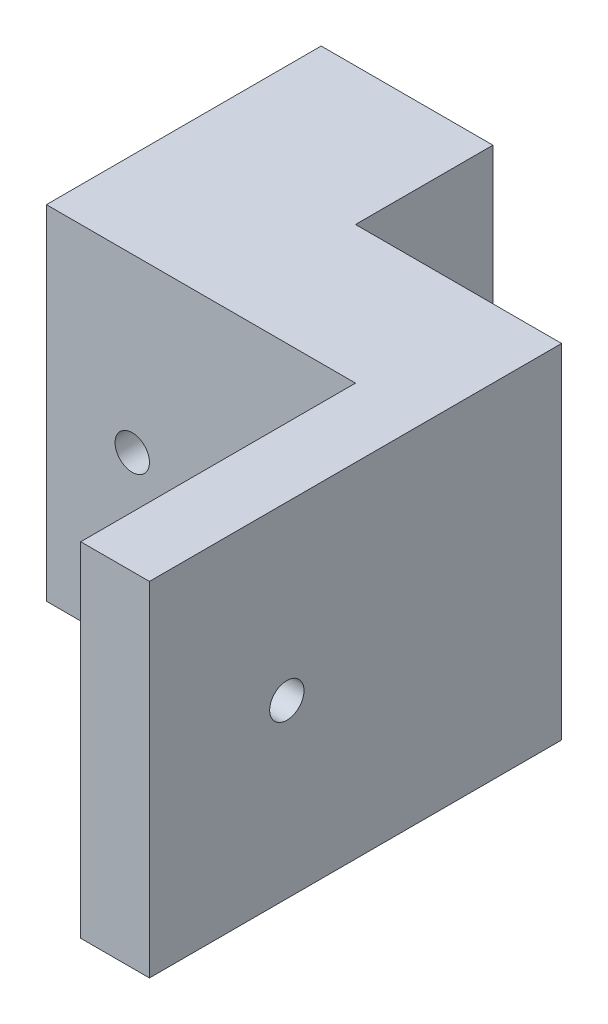
ISO-10303-21;
HEADER;
FILE_DESCRIPTION(('STEP AP214'),'2;1');
FILE_NAME('part.step','',(''),(''),'','','');
FILE_SCHEMA(('AUTOMOTIVE_DESIGN { 1 0 10303 214 1 1 1 1 }'));
ENDSEC;
DATA;
#1=APPLICATION_CONTEXT('core data for automotive mechanical design processes');
#2=APPLICATION_PROTOCOL_DEFINITION('international standard','automotive_design',2000,#1);
#3=PRODUCT_CONTEXT('',#1,'mechanical');
#4=PRODUCT('Part','Part','',(#3));
#5=PRODUCT_RELATED_PRODUCT_CATEGORY('part','',(#4));
#6=PRODUCT_DEFINITION_FORMATION('','',#4);
#7=PRODUCT_DEFINITION_CONTEXT('part definition',#1,'design');
#8=PRODUCT_DEFINITION('design','',#6,#7);
#9=PRODUCT_DEFINITION_SHAPE('','',#8);
#10=(LENGTH_UNIT() NAMED_UNIT(*) SI_UNIT(.MILLI.,.METRE.));
#11=(NAMED_UNIT(*) PLANE_ANGLE_UNIT() SI_UNIT($,.RADIAN.));
#12=(NAMED_UNIT(*) SI_UNIT($,.STERADIAN.) SOLID_ANGLE_UNIT());
#13=UNCERTAINTY_MEASURE_WITH_UNIT(LENGTH_MEASURE(1.E-05),#10,'distance_accuracy_value','');
#14=(GEOMETRIC_REPRESENTATION_CONTEXT(3) GLOBAL_UNCERTAINTY_ASSIGNED_CONTEXT((#13)) GLOBAL_UNIT_ASSIGNED_CONTEXT((#10,
#11,#12)) REPRESENTATION_CONTEXT('',''));
#15=CARTESIAN_POINT('',(0.,0.,0.));
#16=DIRECTION('',(0.,0.,1.));
#17=DIRECTION('',(1.,0.,0.));
#18=AXIS2_PLACEMENT_3D('',#15,#16,#17);
#19=CARTESIAN_POINT('',(-41.0872907389554,30.3800892133009,20.));
#20=DIRECTION('',(1.,0.,0.));
#21=DIRECTION('',(0.,0.,-1.));
#22=AXIS2_PLACEMENT_3D('',#19,#20,#21);
#23=PLANE('',#22);
#24=DIRECTION('',(0.,-1.,0.));
#25=VECTOR('',#24,1.);
#26=CARTESIAN_POINT('',(-41.0872907389554,30.3800892133009,0.));
#27=LINE('',#26,#25);
#28=CARTESIAN_POINT('',(-41.0872907389554,30.3800892133009,0.));
#29=VERTEX_POINT('',#28);
#30=CARTESIAN_POINT('',(-41.0872907389554,-19.6199107866991,0.));
#31=VERTEX_POINT('',#30);
#32=EDGE_CURVE('E90',#29,#31,#27,.T.);
#33=ORIENTED_EDGE('',*,*,#32,.T.);
#34=DIRECTION('',(0.,0.,-1.));
#35=VECTOR('',#34,1.);
#36=CARTESIAN_POINT('',(-41.0872907389554,-19.6199107866991,20.));
#37=LINE('',#36,#35);
#38=CARTESIAN_POINT('',(-41.0872907389554,-19.6199107866991,40.));
#39=VERTEX_POINT('',#38);
#40=EDGE_CURVE('E11',#39,#31,#37,.T.);
#41=ORIENTED_EDGE('',*,*,#40,.F.);
#42=DIRECTION('',(0.,-1.,0.));
#43=VECTOR('',#42,1.);
#44=CARTESIAN_POINT('',(-41.0872907389554,30.3800892133009,40.));
#45=LINE('',#44,#43);
#46=CARTESIAN_POINT('',(-41.0872907389554,30.3800892133009,40.));
#47=VERTEX_POINT('',#46);
#48=EDGE_CURVE('E119',#47,#39,#45,.T.);
#49=ORIENTED_EDGE('',*,*,#48,.F.);
#50=DIRECTION('',(0.,0.,-1.));
#51=VECTOR('',#50,1.);
#52=CARTESIAN_POINT('',(-41.0872907389554,30.3800892133009,20.));
#53=LINE('',#52,#51);
#54=EDGE_CURVE('E85',#47,#29,#53,.T.);
#55=ORIENTED_EDGE('',*,*,#54,.T.);
#56=EDGE_LOOP('',(#33,#41,#49,#55));
#57=FACE_BOUND('',#56,.T.);
#58=ADVANCED_FACE('F35',(#57),#23,.F.);
#59=CARTESIAN_POINT('',(-41.0872907389554,-19.6199107866991,20.));
#60=DIRECTION('',(0.,1.,0.));
#61=DIRECTION('',(0.,0.,1.));
#62=AXIS2_PLACEMENT_3D('',#59,#60,#61);
#63=PLANE('',#62);
#64=DIRECTION('',(1.,0.,0.));
#65=VECTOR('',#64,1.);
#66=CARTESIAN_POINT('',(-41.0872907389554,-19.6199107866991,0.));
#67=LINE('',#66,#65);
#68=CARTESIAN_POINT('',(-16.0872907389554,-19.6199107866991,0.));
#69=VERTEX_POINT('',#68);
#70=EDGE_CURVE('E75',#31,#69,#67,.T.);
#71=ORIENTED_EDGE('',*,*,#70,.T.);
#72=DIRECTION('',(0.,0.,-1.));
#73=VECTOR('',#72,1.);
#74=CARTESIAN_POINT('',(-16.0872907389554,-19.6199107866991,20.));
#75=LINE('',#74,#73);
#76=CARTESIAN_POINT('',(-16.0872907389554,-19.6199107866991,20.));
#77=VERTEX_POINT('',#76);
#78=EDGE_CURVE('E44',#77,#69,#75,.T.);
#79=ORIENTED_EDGE('',*,*,#78,.F.);
#80=DIRECTION('',(1.,0.,0.));
#81=VECTOR('',#80,1.);
#82=CARTESIAN_POINT('',(-41.0872907389554,-19.6199107866991,20.));
#83=LINE('',#82,#81);
#84=CARTESIAN_POINT('',(13.9127092610446,-19.6199107866991,20.));
#85=VERTEX_POINT('',#84);
#86=EDGE_CURVE('E104',#77,#85,#83,.T.);
#87=ORIENTED_EDGE('',*,*,#86,.T.);
#88=DIRECTION('',(0.,0.,-1.));
#89=VECTOR('',#88,1.);
#90=CARTESIAN_POINT('',(13.9127092610446,-19.6199107866991,0.));
#91=LINE('',#90,#89);
#92=CARTESIAN_POINT('',(13.9127092610446,-19.6199107866991,80.));
#93=VERTEX_POINT('',#92);
#94=EDGE_CURVE('E154',#93,#85,#91,.T.);
#95=ORIENTED_EDGE('',*,*,#94,.F.);
#96=DIRECTION('',(-1.,0.,0.));
#97=VECTOR('',#96,1.);
#98=CARTESIAN_POINT('',(13.9127092610446,-19.6199107866991,80.));
#99=LINE('',#98,#97);
#100=CARTESIAN_POINT('',(3.91270926104458,-19.6199107866991,80.));
#101=VERTEX_POINT('',#100);
#102=EDGE_CURVE('E155',#93,#101,#99,.T.);
#103=ORIENTED_EDGE('',*,*,#102,.T.);
#104=DIRECTION('',(0.,0.,-1.));
#105=VECTOR('',#104,1.);
#106=CARTESIAN_POINT('',(3.91270926104458,-19.6199107866991,0.));
#107=LINE('',#106,#105);
#108=CARTESIAN_POINT('',(3.91270926104458,-19.6199107866991,40.));
#109=VERTEX_POINT('',#108);
#110=EDGE_CURVE('E145',#101,#109,#107,.T.);
#111=ORIENTED_EDGE('',*,*,#110,.T.);
#112=DIRECTION('',(1.,0.,0.));
#113=VECTOR('',#112,1.);
#114=CARTESIAN_POINT('',(-41.0872907389554,-19.6199107866991,40.));
#115=LINE('',#114,#113);
#116=EDGE_CURVE('E114',#39,#109,#115,.T.);
#117=ORIENTED_EDGE('',*,*,#116,.F.);
#118=ORIENTED_EDGE('',*,*,#40,.T.);
#119=EDGE_LOOP('',(#71,#79,#87,#95,#103,#111,#117,#118));
#120=FACE_BOUND('',#119,.T.);
#121=ADVANCED_FACE('F108',(#120),#63,.F.);
#122=CARTESIAN_POINT('',(-16.0872907389554,30.3800892133009,20.));
#123=DIRECTION('',(-1.,0.,0.));
#124=DIRECTION('',(0.,0.,1.));
#125=AXIS2_PLACEMENT_3D('',#122,#123,#124);
#126=PLANE('',#125);
#127=DIRECTION('',(0.,1.,0.));
#128=VECTOR('',#127,1.);
#129=CARTESIAN_POINT('',(-16.0872907389554,30.3800892133009,0.));
#130=LINE('',#129,#128);
#131=CARTESIAN_POINT('',(-16.0872907389554,30.3800892133009,0.));
#132=VERTEX_POINT('',#131);
#133=EDGE_CURVE('E67',#69,#132,#130,.T.);
#134=ORIENTED_EDGE('',*,*,#133,.T.);
#135=DIRECTION('',(0.,0.,-1.));
#136=VECTOR('',#135,1.);
#137=CARTESIAN_POINT('',(-16.0872907389554,30.3800892133009,20.));
#138=LINE('',#137,#136);
#139=CARTESIAN_POINT('',(-16.0872907389554,30.3800892133009,20.));
#140=VERTEX_POINT('',#139);
#141=EDGE_CURVE('E70',#140,#132,#138,.T.);
#142=ORIENTED_EDGE('',*,*,#141,.F.);
#143=DIRECTION('',(0.,1.,0.));
#144=VECTOR('',#143,1.);
#145=CARTESIAN_POINT('',(-16.0872907389554,30.3800892133009,20.));
#146=LINE('',#145,#144);
#147=EDGE_CURVE('E91',#77,#140,#146,.T.);
#148=ORIENTED_EDGE('',*,*,#147,.F.);
#149=ORIENTED_EDGE('',*,*,#78,.T.);
#150=EDGE_LOOP('',(#134,#142,#148,#149));
#151=FACE_BOUND('',#150,.T.);
#152=ADVANCED_FACE('F69',(#151),#126,.F.);
#153=CARTESIAN_POINT('',(-41.0872907389554,30.3800892133009,20.));
#154=DIRECTION('',(0.,-1.,0.));
#155=DIRECTION('',(0.,0.,-1.));
#156=AXIS2_PLACEMENT_3D('',#153,#154,#155);
#157=PLANE('',#156);
#158=DIRECTION('',(-1.,0.,0.));
#159=VECTOR('',#158,1.);
#160=CARTESIAN_POINT('',(-41.0872907389554,30.3800892133009,0.));
#161=LINE('',#160,#159);
#162=EDGE_CURVE('E74',#132,#29,#161,.T.);
#163=ORIENTED_EDGE('',*,*,#162,.T.);
#164=ORIENTED_EDGE('',*,*,#54,.F.);
#165=DIRECTION('',(-1.,0.,0.));
#166=VECTOR('',#165,1.);
#167=CARTESIAN_POINT('',(-41.0872907389554,30.3800892133009,40.));
#168=LINE('',#167,#166);
#169=CARTESIAN_POINT('',(3.91270926104458,30.3800892133009,40.));
#170=VERTEX_POINT('',#169);
#171=EDGE_CURVE('E107',#170,#47,#168,.T.);
#172=ORIENTED_EDGE('',*,*,#171,.F.);
#173=DIRECTION('',(0.,0.,1.));
#174=VECTOR('',#173,1.);
#175=CARTESIAN_POINT('',(3.91270926104458,30.3800892133009,0.));
#176=LINE('',#175,#174);
#177=CARTESIAN_POINT('',(3.91270926104458,30.3800892133009,80.));
#178=VERTEX_POINT('',#177);
#179=EDGE_CURVE('E137',#170,#178,#176,.T.);
#180=ORIENTED_EDGE('',*,*,#179,.T.);
#181=DIRECTION('',(-1.,0.,0.));
#182=VECTOR('',#181,1.);
#183=CARTESIAN_POINT('',(13.9127092610446,30.3800892133009,80.));
#184=LINE('',#183,#182);
#185=CARTESIAN_POINT('',(13.9127092610446,30.3800892133009,80.));
#186=VERTEX_POINT('',#185);
#187=EDGE_CURVE('E157',#186,#178,#184,.T.);
#188=ORIENTED_EDGE('',*,*,#187,.F.);
#189=DIRECTION('',(0.,0.,1.));
#190=VECTOR('',#189,1.);
#191=CARTESIAN_POINT('',(13.9127092610446,30.3800892133009,0.));
#192=LINE('',#191,#190);
#193=CARTESIAN_POINT('',(13.9127092610446,30.3800892133009,20.));
#194=VERTEX_POINT('',#193);
#195=EDGE_CURVE('E180',#194,#186,#192,.T.);
#196=ORIENTED_EDGE('',*,*,#195,.F.);
#197=DIRECTION('',(-1.,0.,0.));
#198=VECTOR('',#197,1.);
#199=CARTESIAN_POINT('',(-41.0872907389554,30.3800892133009,20.));
#200=LINE('',#199,#198);
#201=EDGE_CURVE('E84',#194,#140,#200,.T.);
#202=ORIENTED_EDGE('',*,*,#201,.T.);
#203=ORIENTED_EDGE('',*,*,#141,.T.);
#204=EDGE_LOOP('',(#163,#164,#172,#180,#188,#196,#202,#203));
#205=FACE_BOUND('',#204,.T.);
#206=ADVANCED_FACE('F79',(#205),#157,.F.);
#207=CARTESIAN_POINT('',(0.,0.,0.));
#208=DIRECTION('',(0.,0.,1.));
#209=DIRECTION('',(1.,0.,0.));
#210=AXIS2_PLACEMENT_3D('',#207,#208,#209);
#211=PLANE('',#210);
#212=CARTESIAN_POINT('',(-28.5872907389554,5.38008921330089,0.));
#213=DIRECTION('',(0.,0.,-1.));
#214=DIRECTION('',(-1.,0.,0.));
#215=AXIS2_PLACEMENT_3D('',#212,#213,#214);
#216=CIRCLE('',#215,2.49999999999999);
#217=CARTESIAN_POINT('',(-31.0872907389554,5.38008921330089,0.));
#218=VERTEX_POINT('',#217);
#219=EDGE_CURVE('E208',#218,#218,#216,.T.);
#220=ORIENTED_EDGE('',*,*,#219,.F.);
#221=EDGE_LOOP('',(#220));
#222=FACE_BOUND('',#221,.T.);
#223=ORIENTED_EDGE('',*,*,#32,.F.);
#224=ORIENTED_EDGE('',*,*,#162,.F.);
#225=ORIENTED_EDGE('',*,*,#133,.F.);
#226=ORIENTED_EDGE('',*,*,#70,.F.);
#227=EDGE_LOOP('',(#223,#224,#225,#226));
#228=FACE_BOUND('',#227,.T.);
#229=ADVANCED_FACE('F88',(#222,#228),#211,.F.);
#230=CARTESIAN_POINT('',(0.,0.,20.));
#231=DIRECTION('',(0.,0.,1.));
#232=DIRECTION('',(1.,0.,0.));
#233=AXIS2_PLACEMENT_3D('',#230,#231,#232);
#234=PLANE('',#233);
#235=ORIENTED_EDGE('',*,*,#86,.F.);
#236=ORIENTED_EDGE('',*,*,#147,.T.);
#237=ORIENTED_EDGE('',*,*,#201,.F.);
#238=DIRECTION('',(0.,1.,0.));
#239=VECTOR('',#238,1.);
#240=CARTESIAN_POINT('',(13.9127092610446,0.,20.));
#241=LINE('',#240,#239);
#242=EDGE_CURVE('E176',#85,#194,#241,.T.);
#243=ORIENTED_EDGE('',*,*,#242,.F.);
#244=EDGE_LOOP('',(#235,#236,#237,#243));
#245=FACE_BOUND('',#244,.T.);
#246=ADVANCED_FACE('F177',(#245),#234,.F.);
#247=CARTESIAN_POINT('',(0.,0.,40.));
#248=DIRECTION('',(0.,0.,1.));
#249=DIRECTION('',(1.,0.,0.));
#250=AXIS2_PLACEMENT_3D('',#247,#248,#249);
#251=PLANE('',#250);
#252=CARTESIAN_POINT('',(-28.5872907389554,5.38008921330089,40.));
#253=DIRECTION('',(0.,0.,1.));
#254=DIRECTION('',(1.,0.,0.));
#255=AXIS2_PLACEMENT_3D('',#252,#253,#254);
#256=CIRCLE('',#255,2.49999999999999);
#257=CARTESIAN_POINT('',(-26.0872907389554,5.38008921330089,40.));
#258=VERTEX_POINT('',#257);
#259=EDGE_CURVE('E204',#258,#258,#256,.T.);
#260=ORIENTED_EDGE('',*,*,#259,.F.);
#261=EDGE_LOOP('',(#260));
#262=FACE_BOUND('',#261,.T.);
#263=ORIENTED_EDGE('',*,*,#48,.T.);
#264=ORIENTED_EDGE('',*,*,#116,.T.);
#265=DIRECTION('',(0.,1.,0.));
#266=VECTOR('',#265,1.);
#267=CARTESIAN_POINT('',(3.91270926104458,-19.6199107866991,40.));
#268=LINE('',#267,#266);
#269=EDGE_CURVE('E128',#109,#170,#268,.T.);
#270=ORIENTED_EDGE('',*,*,#269,.T.);
#271=ORIENTED_EDGE('',*,*,#171,.T.);
#272=EDGE_LOOP('',(#263,#264,#270,#271));
#273=FACE_BOUND('',#272,.T.);
#274=ADVANCED_FACE('F126',(#262,#273),#251,.T.);
#275=CARTESIAN_POINT('',(13.9127092610446,0.,80.));
#276=DIRECTION('',(0.,0.,-1.));
#277=DIRECTION('',(0.,1.,0.));
#278=AXIS2_PLACEMENT_3D('',#275,#276,#277);
#279=PLANE('',#278);
#280=DIRECTION('',(0.,-1.,0.));
#281=VECTOR('',#280,1.);
#282=CARTESIAN_POINT('',(3.91270926104458,0.,80.));
#283=LINE('',#282,#281);
#284=EDGE_CURVE('E144',#178,#101,#283,.T.);
#285=ORIENTED_EDGE('',*,*,#284,.T.);
#286=ORIENTED_EDGE('',*,*,#102,.F.);
#287=DIRECTION('',(0.,-1.,0.));
#288=VECTOR('',#287,1.);
#289=CARTESIAN_POINT('',(13.9127092610446,0.,80.));
#290=LINE('',#289,#288);
#291=EDGE_CURVE('E158',#186,#93,#290,.T.);
#292=ORIENTED_EDGE('',*,*,#291,.F.);
#293=ORIENTED_EDGE('',*,*,#187,.T.);
#294=EDGE_LOOP('',(#285,#286,#292,#293));
#295=FACE_BOUND('',#294,.T.);
#296=ADVANCED_FACE('F193',(#295),#279,.F.);
#297=CARTESIAN_POINT('',(13.9127092610446,0.,0.));
#298=DIRECTION('',(1.,0.,0.));
#299=DIRECTION('',(0.,0.,-1.));
#300=AXIS2_PLACEMENT_3D('',#297,#298,#299);
#301=PLANE('',#300);
#302=CARTESIAN_POINT('',(13.9127092610446,5.38008921330089,60.));
#303=DIRECTION('',(1.,0.,0.));
#304=DIRECTION('',(0.,0.,-1.));
#305=AXIS2_PLACEMENT_3D('',#302,#303,#304);
#306=CIRCLE('',#305,2.5);
#307=CARTESIAN_POINT('',(13.9127092610446,5.38008921330089,57.5));
#308=VERTEX_POINT('',#307);
#309=EDGE_CURVE('E187',#308,#308,#306,.T.);
#310=ORIENTED_EDGE('',*,*,#309,.F.);
#311=EDGE_LOOP('',(#310));
#312=FACE_BOUND('',#311,.T.);
#313=ORIENTED_EDGE('',*,*,#94,.T.);
#314=ORIENTED_EDGE('',*,*,#242,.T.);
#315=ORIENTED_EDGE('',*,*,#195,.T.);
#316=ORIENTED_EDGE('',*,*,#291,.T.);
#317=EDGE_LOOP('',(#313,#314,#315,#316));
#318=FACE_BOUND('',#317,.T.);
#319=ADVANCED_FACE('F183',(#312,#318),#301,.T.);
#320=CARTESIAN_POINT('',(3.91270926104458,0.,0.));
#321=DIRECTION('',(1.,0.,0.));
#322=DIRECTION('',(0.,0.,-1.));
#323=AXIS2_PLACEMENT_3D('',#320,#321,#322);
#324=PLANE('',#323);
#325=CARTESIAN_POINT('',(3.91270926104458,5.38008921330089,60.));
#326=DIRECTION('',(-1.,0.,0.));
#327=DIRECTION('',(0.,0.,1.));
#328=AXIS2_PLACEMENT_3D('',#325,#326,#327);
#329=CIRCLE('',#328,2.5);
#330=CARTESIAN_POINT('',(3.91270926104458,5.38008921330089,62.5));
#331=VERTEX_POINT('',#330);
#332=EDGE_CURVE('E200',#331,#331,#329,.T.);
#333=ORIENTED_EDGE('',*,*,#332,.F.);
#334=EDGE_LOOP('',(#333));
#335=FACE_BOUND('',#334,.T.);
#336=ORIENTED_EDGE('',*,*,#269,.F.);
#337=ORIENTED_EDGE('',*,*,#110,.F.);
#338=ORIENTED_EDGE('',*,*,#284,.F.);
#339=ORIENTED_EDGE('',*,*,#179,.F.);
#340=EDGE_LOOP('',(#336,#337,#338,#339));
#341=FACE_BOUND('',#340,.T.);
#342=ADVANCED_FACE('F198',(#335,#341),#324,.F.);
#343=CARTESIAN_POINT('',(3.91270926104458,5.38008921330089,60.));
#344=DIRECTION('',(-1.,0.,0.));
#345=DIRECTION('',(0.,0.,1.));
#346=AXIS2_PLACEMENT_3D('',#343,#344,#345);
#347=CYLINDRICAL_SURFACE('',#346,2.5);
#348=ORIENTED_EDGE('',*,*,#309,.T.);
#349=EDGE_LOOP('',(#348));
#350=FACE_BOUND('',#349,.T.);
#351=ORIENTED_EDGE('',*,*,#332,.T.);
#352=EDGE_LOOP('',(#351));
#353=FACE_BOUND('',#352,.T.);
#354=ADVANCED_FACE('F278',(#350,#353),#347,.F.);
#355=CARTESIAN_POINT('',(-28.5872907389554,5.38008921330089,0.));
#356=DIRECTION('',(0.,0.,-1.));
#357=DIRECTION('',(-1.,0.,0.));
#358=AXIS2_PLACEMENT_3D('',#355,#356,#357);
#359=CYLINDRICAL_SURFACE('',#358,2.49999999999999);
#360=ORIENTED_EDGE('',*,*,#259,.T.);
#361=EDGE_LOOP('',(#360));
#362=FACE_BOUND('',#361,.T.);
#363=ORIENTED_EDGE('',*,*,#219,.T.);
#364=EDGE_LOOP('',(#363));
#365=FACE_BOUND('',#364,.T.);
#366=ADVANCED_FACE('F214',(#362,#365),#359,.F.);
#367=CLOSED_SHELL('',(#58,#121,#152,#206,#229,#246,#274,#296,#319,#342,#354,#366));
#368=MANIFOLD_SOLID_BREP('B2',#367);
#369=ADVANCED_BREP_SHAPE_REPRESENTATION('',(#18,#368),#14);
#370=SHAPE_DEFINITION_REPRESENTATION(#9,#369);
ENDSEC;
END-ISO-10303-21;
